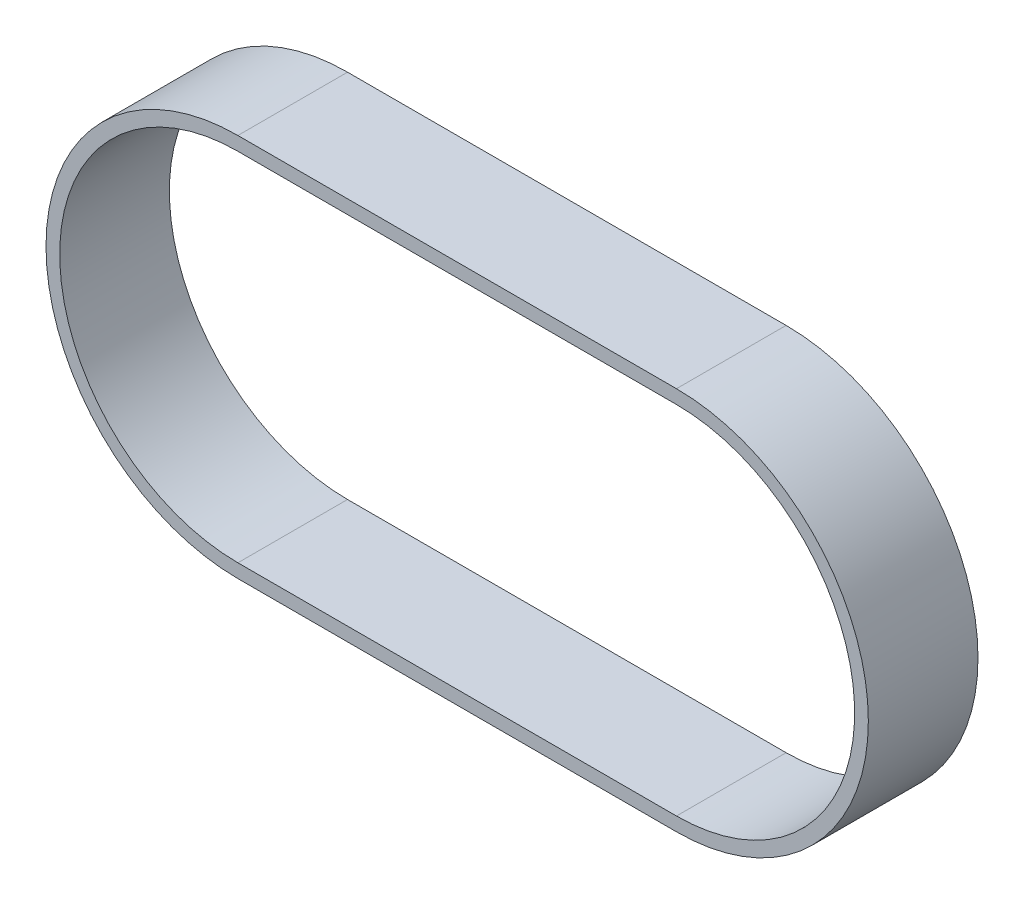
ISO-10303-21;
HEADER;
FILE_DESCRIPTION(('STEP AP214'),'2;1');
FILE_NAME('part.step','',(''),(''),'','','');
FILE_SCHEMA(('AUTOMOTIVE_DESIGN { 1 0 10303 214 1 1 1 1 }'));
ENDSEC;
DATA;
#1=APPLICATION_CONTEXT('core data for automotive mechanical design processes');
#2=APPLICATION_PROTOCOL_DEFINITION('international standard','automotive_design',2000,#1);
#3=PRODUCT_CONTEXT('',#1,'mechanical');
#4=PRODUCT('Part','Part','',(#3));
#5=PRODUCT_RELATED_PRODUCT_CATEGORY('part','',(#4));
#6=PRODUCT_DEFINITION_FORMATION('','',#4);
#7=PRODUCT_DEFINITION_CONTEXT('part definition',#1,'design');
#8=PRODUCT_DEFINITION('design','',#6,#7);
#9=PRODUCT_DEFINITION_SHAPE('','',#8);
#10=(LENGTH_UNIT() NAMED_UNIT(*) SI_UNIT(.MILLI.,.METRE.));
#11=(NAMED_UNIT(*) PLANE_ANGLE_UNIT() SI_UNIT($,.RADIAN.));
#12=(NAMED_UNIT(*) SI_UNIT($,.STERADIAN.) SOLID_ANGLE_UNIT());
#13=UNCERTAINTY_MEASURE_WITH_UNIT(LENGTH_MEASURE(1.E-05),#10,'distance_accuracy_value','');
#14=(GEOMETRIC_REPRESENTATION_CONTEXT(3) GLOBAL_UNCERTAINTY_ASSIGNED_CONTEXT((#13)) GLOBAL_UNIT_ASSIGNED_CONTEXT((#10,
#11,#12)) REPRESENTATION_CONTEXT('',''));
#15=CARTESIAN_POINT('',(0.,0.,0.));
#16=DIRECTION('',(0.,0.,1.));
#17=DIRECTION('',(1.,0.,0.));
#18=AXIS2_PLACEMENT_3D('',#15,#16,#17);
#19=CARTESIAN_POINT('',(0.,0.,20.));
#20=DIRECTION('',(0.,0.,1.));
#21=DIRECTION('',(1.,0.,0.));
#22=AXIS2_PLACEMENT_3D('',#19,#20,#21);
#23=PLANE('',#22);
#24=CARTESIAN_POINT('',(0.,0.,20.));
#25=DIRECTION('',(0.,0.,1.));
#26=DIRECTION('',(1.,0.,0.));
#27=AXIS2_PLACEMENT_3D('',#24,#25,#26);
#28=CIRCLE('',#27,35.);
#29=CARTESIAN_POINT('',(0.,35.,20.));
#30=VERTEX_POINT('',#29);
#31=CARTESIAN_POINT('',(0.,-35.,20.));
#32=VERTEX_POINT('',#31);
#33=EDGE_CURVE('E134',#30,#32,#28,.T.);
#34=ORIENTED_EDGE('',*,*,#33,.T.);
#35=DIRECTION('',(1.,0.,0.));
#36=VECTOR('',#35,1.);
#37=CARTESIAN_POINT('',(0.,-35.,20.));
#38=LINE('',#37,#36);
#39=CARTESIAN_POINT('',(80.,-35.,20.));
#40=VERTEX_POINT('',#39);
#41=EDGE_CURVE('E137',#32,#40,#38,.T.);
#42=ORIENTED_EDGE('',*,*,#41,.T.);
#43=CARTESIAN_POINT('',(80.,0.,20.));
#44=DIRECTION('',(0.,0.,1.));
#45=DIRECTION('',(1.,0.,0.));
#46=AXIS2_PLACEMENT_3D('',#43,#44,#45);
#47=CIRCLE('',#46,35.);
#48=CARTESIAN_POINT('',(80.,35.,20.));
#49=VERTEX_POINT('',#48);
#50=EDGE_CURVE('E140',#40,#49,#47,.T.);
#51=ORIENTED_EDGE('',*,*,#50,.T.);
#52=DIRECTION('',(-1.,0.,0.));
#53=VECTOR('',#52,1.);
#54=CARTESIAN_POINT('',(0.,35.,20.));
#55=LINE('',#54,#53);
#56=EDGE_CURVE('E142',#49,#30,#55,.T.);
#57=ORIENTED_EDGE('',*,*,#56,.T.);
#58=EDGE_LOOP('',(#34,#42,#51,#57));
#59=FACE_BOUND('',#58,.T.);
#60=DIRECTION('',(1.,0.,0.));
#61=VECTOR('',#60,1.);
#62=CARTESIAN_POINT('',(0.,-32.5,20.));
#63=LINE('',#62,#61);
#64=CARTESIAN_POINT('',(0.,-32.5,20.));
#65=VERTEX_POINT('',#64);
#66=CARTESIAN_POINT('',(80.,-32.5,20.));
#67=VERTEX_POINT('',#66);
#68=EDGE_CURVE('E106',#65,#67,#63,.T.);
#69=ORIENTED_EDGE('',*,*,#68,.F.);
#70=CARTESIAN_POINT('',(0.,0.,20.));
#71=DIRECTION('',(0.,0.,1.));
#72=DIRECTION('',(1.,0.,0.));
#73=AXIS2_PLACEMENT_3D('',#70,#71,#72);
#74=CIRCLE('',#73,32.5);
#75=CARTESIAN_POINT('',(0.,32.5,20.));
#76=VERTEX_POINT('',#75);
#77=EDGE_CURVE('E98',#76,#65,#74,.T.);
#78=ORIENTED_EDGE('',*,*,#77,.F.);
#79=DIRECTION('',(-1.,0.,0.));
#80=VECTOR('',#79,1.);
#81=CARTESIAN_POINT('',(0.,32.5,20.));
#82=LINE('',#81,#80);
#83=CARTESIAN_POINT('',(80.,32.5,20.));
#84=VERTEX_POINT('',#83);
#85=EDGE_CURVE('E120',#84,#76,#82,.T.);
#86=ORIENTED_EDGE('',*,*,#85,.F.);
#87=CARTESIAN_POINT('',(80.,0.,20.));
#88=DIRECTION('',(0.,0.,1.));
#89=DIRECTION('',(1.,0.,0.));
#90=AXIS2_PLACEMENT_3D('',#87,#88,#89);
#91=CIRCLE('',#90,32.5);
#92=EDGE_CURVE('E118',#67,#84,#91,.T.);
#93=ORIENTED_EDGE('',*,*,#92,.F.);
#94=EDGE_LOOP('',(#69,#78,#86,#93));
#95=FACE_BOUND('',#94,.T.);
#96=ADVANCED_FACE('F33',(#59,#95),#23,.T.);
#97=CARTESIAN_POINT('',(0.,0.,0.));
#98=DIRECTION('',(0.,0.,1.));
#99=DIRECTION('',(1.,0.,0.));
#100=AXIS2_PLACEMENT_3D('',#97,#98,#99);
#101=PLANE('',#100);
#102=CARTESIAN_POINT('',(0.,0.,0.));
#103=DIRECTION('',(0.,0.,1.));
#104=DIRECTION('',(1.,0.,0.));
#105=AXIS2_PLACEMENT_3D('',#102,#103,#104);
#106=CIRCLE('',#105,35.);
#107=CARTESIAN_POINT('',(0.,35.,0.));
#108=VERTEX_POINT('',#107);
#109=CARTESIAN_POINT('',(0.,-35.,0.));
#110=VERTEX_POINT('',#109);
#111=EDGE_CURVE('E114',#108,#110,#106,.T.);
#112=ORIENTED_EDGE('',*,*,#111,.F.);
#113=DIRECTION('',(-1.,0.,0.));
#114=VECTOR('',#113,1.);
#115=CARTESIAN_POINT('',(0.,35.,0.));
#116=LINE('',#115,#114);
#117=CARTESIAN_POINT('',(80.,35.,0.));
#118=VERTEX_POINT('',#117);
#119=EDGE_CURVE('E138',#118,#108,#116,.T.);
#120=ORIENTED_EDGE('',*,*,#119,.F.);
#121=CARTESIAN_POINT('',(80.,0.,0.));
#122=DIRECTION('',(0.,0.,1.));
#123=DIRECTION('',(1.,0.,0.));
#124=AXIS2_PLACEMENT_3D('',#121,#122,#123);
#125=CIRCLE('',#124,35.);
#126=CARTESIAN_POINT('',(80.,-35.,0.));
#127=VERTEX_POINT('',#126);
#128=EDGE_CURVE('E149',#127,#118,#125,.T.);
#129=ORIENTED_EDGE('',*,*,#128,.F.);
#130=DIRECTION('',(1.,0.,0.));
#131=VECTOR('',#130,1.);
#132=CARTESIAN_POINT('',(0.,-35.,0.));
#133=LINE('',#132,#131);
#134=EDGE_CURVE('E147',#110,#127,#133,.T.);
#135=ORIENTED_EDGE('',*,*,#134,.F.);
#136=EDGE_LOOP('',(#112,#120,#129,#135));
#137=FACE_BOUND('',#136,.T.);
#138=CARTESIAN_POINT('',(0.,0.,0.));
#139=DIRECTION('',(0.,0.,1.));
#140=DIRECTION('',(1.,0.,0.));
#141=AXIS2_PLACEMENT_3D('',#138,#139,#140);
#142=CIRCLE('',#141,32.5);
#143=CARTESIAN_POINT('',(0.,32.5,0.));
#144=VERTEX_POINT('',#143);
#145=CARTESIAN_POINT('',(0.,-32.5,0.));
#146=VERTEX_POINT('',#145);
#147=EDGE_CURVE('E56',#144,#146,#142,.T.);
#148=ORIENTED_EDGE('',*,*,#147,.T.);
#149=DIRECTION('',(1.,0.,0.));
#150=VECTOR('',#149,1.);
#151=CARTESIAN_POINT('',(0.,-32.5,0.));
#152=LINE('',#151,#150);
#153=CARTESIAN_POINT('',(80.,-32.5,0.));
#154=VERTEX_POINT('',#153);
#155=EDGE_CURVE('E113',#146,#154,#152,.T.);
#156=ORIENTED_EDGE('',*,*,#155,.T.);
#157=CARTESIAN_POINT('',(80.,0.,0.));
#158=DIRECTION('',(0.,0.,1.));
#159=DIRECTION('',(1.,0.,0.));
#160=AXIS2_PLACEMENT_3D('',#157,#158,#159);
#161=CIRCLE('',#160,32.5);
#162=CARTESIAN_POINT('',(80.,32.5,0.));
#163=VERTEX_POINT('',#162);
#164=EDGE_CURVE('E126',#154,#163,#161,.T.);
#165=ORIENTED_EDGE('',*,*,#164,.T.);
#166=DIRECTION('',(-1.,0.,0.));
#167=VECTOR('',#166,1.);
#168=CARTESIAN_POINT('',(0.,32.5,0.));
#169=LINE('',#168,#167);
#170=EDGE_CURVE('E107',#163,#144,#169,.T.);
#171=ORIENTED_EDGE('',*,*,#170,.T.);
#172=EDGE_LOOP('',(#148,#156,#165,#171));
#173=FACE_BOUND('',#172,.T.);
#174=ADVANCED_FACE('F167',(#137,#173),#101,.F.);
#175=CARTESIAN_POINT('',(0.,0.,20.));
#176=DIRECTION('',(0.,0.,-1.));
#177=DIRECTION('',(-1.,0.,0.));
#178=AXIS2_PLACEMENT_3D('',#175,#176,#177);
#179=CYLINDRICAL_SURFACE('',#178,35.);
#180=ORIENTED_EDGE('',*,*,#111,.T.);
#181=DIRECTION('',(0.,0.,-1.));
#182=VECTOR('',#181,1.);
#183=CARTESIAN_POINT('',(0.,-35.,20.));
#184=LINE('',#183,#182);
#185=EDGE_CURVE('E11',#32,#110,#184,.T.);
#186=ORIENTED_EDGE('',*,*,#185,.F.);
#187=ORIENTED_EDGE('',*,*,#33,.F.);
#188=DIRECTION('',(0.,0.,-1.));
#189=VECTOR('',#188,1.);
#190=CARTESIAN_POINT('',(0.,35.,20.));
#191=LINE('',#190,#189);
#192=EDGE_CURVE('E144',#30,#108,#191,.T.);
#193=ORIENTED_EDGE('',*,*,#192,.T.);
#194=EDGE_LOOP('',(#180,#186,#187,#193));
#195=FACE_BOUND('',#194,.T.);
#196=ADVANCED_FACE('F35',(#195),#179,.T.);
#197=CARTESIAN_POINT('',(0.,-35.,20.));
#198=DIRECTION('',(0.,1.,0.));
#199=DIRECTION('',(-1.,0.,0.));
#200=AXIS2_PLACEMENT_3D('',#197,#198,#199);
#201=PLANE('',#200);
#202=ORIENTED_EDGE('',*,*,#134,.T.);
#203=DIRECTION('',(0.,0.,-1.));
#204=VECTOR('',#203,1.);
#205=CARTESIAN_POINT('',(80.,-35.,20.));
#206=LINE('',#205,#204);
#207=EDGE_CURVE('E41',#40,#127,#206,.T.);
#208=ORIENTED_EDGE('',*,*,#207,.F.);
#209=ORIENTED_EDGE('',*,*,#41,.F.);
#210=ORIENTED_EDGE('',*,*,#185,.T.);
#211=EDGE_LOOP('',(#202,#208,#209,#210));
#212=FACE_BOUND('',#211,.T.);
#213=ADVANCED_FACE('F177',(#212),#201,.F.);
#214=CARTESIAN_POINT('',(80.,0.,20.));
#215=DIRECTION('',(0.,0.,-1.));
#216=DIRECTION('',(-1.,0.,0.));
#217=AXIS2_PLACEMENT_3D('',#214,#215,#216);
#218=CYLINDRICAL_SURFACE('',#217,35.);
#219=ORIENTED_EDGE('',*,*,#128,.T.);
#220=DIRECTION('',(0.,0.,-1.));
#221=VECTOR('',#220,1.);
#222=CARTESIAN_POINT('',(80.,35.,20.));
#223=LINE('',#222,#221);
#224=EDGE_CURVE('E154',#49,#118,#223,.T.);
#225=ORIENTED_EDGE('',*,*,#224,.F.);
#226=ORIENTED_EDGE('',*,*,#50,.F.);
#227=ORIENTED_EDGE('',*,*,#207,.T.);
#228=EDGE_LOOP('',(#219,#225,#226,#227));
#229=FACE_BOUND('',#228,.T.);
#230=ADVANCED_FACE('F161',(#229),#218,.T.);
#231=CARTESIAN_POINT('',(0.,35.,20.));
#232=DIRECTION('',(0.,-1.,0.));
#233=DIRECTION('',(1.,0.,0.));
#234=AXIS2_PLACEMENT_3D('',#231,#232,#233);
#235=PLANE('',#234);
#236=ORIENTED_EDGE('',*,*,#119,.T.);
#237=ORIENTED_EDGE('',*,*,#192,.F.);
#238=ORIENTED_EDGE('',*,*,#56,.F.);
#239=ORIENTED_EDGE('',*,*,#224,.T.);
#240=EDGE_LOOP('',(#236,#237,#238,#239));
#241=FACE_BOUND('',#240,.T.);
#242=ADVANCED_FACE('F171',(#241),#235,.F.);
#243=CARTESIAN_POINT('',(0.,0.,20.));
#244=DIRECTION('',(0.,0.,-1.));
#245=DIRECTION('',(-1.,0.,0.));
#246=AXIS2_PLACEMENT_3D('',#243,#244,#245);
#247=CYLINDRICAL_SURFACE('',#246,32.5);
#248=ORIENTED_EDGE('',*,*,#147,.F.);
#249=DIRECTION('',(0.,0.,-1.));
#250=VECTOR('',#249,1.);
#251=CARTESIAN_POINT('',(0.,32.5,20.));
#252=LINE('',#251,#250);
#253=EDGE_CURVE('E102',#76,#144,#252,.T.);
#254=ORIENTED_EDGE('',*,*,#253,.F.);
#255=ORIENTED_EDGE('',*,*,#77,.T.);
#256=DIRECTION('',(0.,0.,-1.));
#257=VECTOR('',#256,1.);
#258=CARTESIAN_POINT('',(0.,-32.5,20.));
#259=LINE('',#258,#257);
#260=EDGE_CURVE('E101',#65,#146,#259,.T.);
#261=ORIENTED_EDGE('',*,*,#260,.T.);
#262=EDGE_LOOP('',(#248,#254,#255,#261));
#263=FACE_BOUND('',#262,.T.);
#264=ADVANCED_FACE('F100',(#263),#247,.F.);
#265=CARTESIAN_POINT('',(0.,-32.5,20.));
#266=DIRECTION('',(0.,1.,0.));
#267=DIRECTION('',(0.,0.,1.));
#268=AXIS2_PLACEMENT_3D('',#265,#266,#267);
#269=PLANE('',#268);
#270=ORIENTED_EDGE('',*,*,#155,.F.);
#271=ORIENTED_EDGE('',*,*,#260,.F.);
#272=ORIENTED_EDGE('',*,*,#68,.T.);
#273=DIRECTION('',(0.,0.,-1.));
#274=VECTOR('',#273,1.);
#275=CARTESIAN_POINT('',(80.,-32.5,20.));
#276=LINE('',#275,#274);
#277=EDGE_CURVE('E115',#67,#154,#276,.T.);
#278=ORIENTED_EDGE('',*,*,#277,.T.);
#279=EDGE_LOOP('',(#270,#271,#272,#278));
#280=FACE_BOUND('',#279,.T.);
#281=ADVANCED_FACE('F110',(#280),#269,.T.);
#282=CARTESIAN_POINT('',(80.,0.,20.));
#283=DIRECTION('',(0.,0.,-1.));
#284=DIRECTION('',(-1.,0.,0.));
#285=AXIS2_PLACEMENT_3D('',#282,#283,#284);
#286=CYLINDRICAL_SURFACE('',#285,32.5);
#287=ORIENTED_EDGE('',*,*,#164,.F.);
#288=ORIENTED_EDGE('',*,*,#277,.F.);
#289=ORIENTED_EDGE('',*,*,#92,.T.);
#290=DIRECTION('',(0.,0.,-1.));
#291=VECTOR('',#290,1.);
#292=CARTESIAN_POINT('',(80.,32.5,20.));
#293=LINE('',#292,#291);
#294=EDGE_CURVE('E48',#84,#163,#293,.T.);
#295=ORIENTED_EDGE('',*,*,#294,.T.);
#296=EDGE_LOOP('',(#287,#288,#289,#295));
#297=FACE_BOUND('',#296,.T.);
#298=ADVANCED_FACE('F200',(#297),#286,.F.);
#299=CARTESIAN_POINT('',(0.,32.5,20.));
#300=DIRECTION('',(0.,-1.,0.));
#301=DIRECTION('',(0.,0.,-1.));
#302=AXIS2_PLACEMENT_3D('',#299,#300,#301);
#303=PLANE('',#302);
#304=ORIENTED_EDGE('',*,*,#170,.F.);
#305=ORIENTED_EDGE('',*,*,#294,.F.);
#306=ORIENTED_EDGE('',*,*,#85,.T.);
#307=ORIENTED_EDGE('',*,*,#253,.T.);
#308=EDGE_LOOP('',(#304,#305,#306,#307));
#309=FACE_BOUND('',#308,.T.);
#310=ADVANCED_FACE('F204',(#309),#303,.T.);
#311=CLOSED_SHELL('',(#96,#174,#196,#213,#230,#242,#264,#281,#298,#310));
#312=MANIFOLD_SOLID_BREP('B2',#311);
#313=ADVANCED_BREP_SHAPE_REPRESENTATION('',(#18,#312),#14);
#314=SHAPE_DEFINITION_REPRESENTATION(#9,#313);
ENDSEC;
END-ISO-10303-21;
